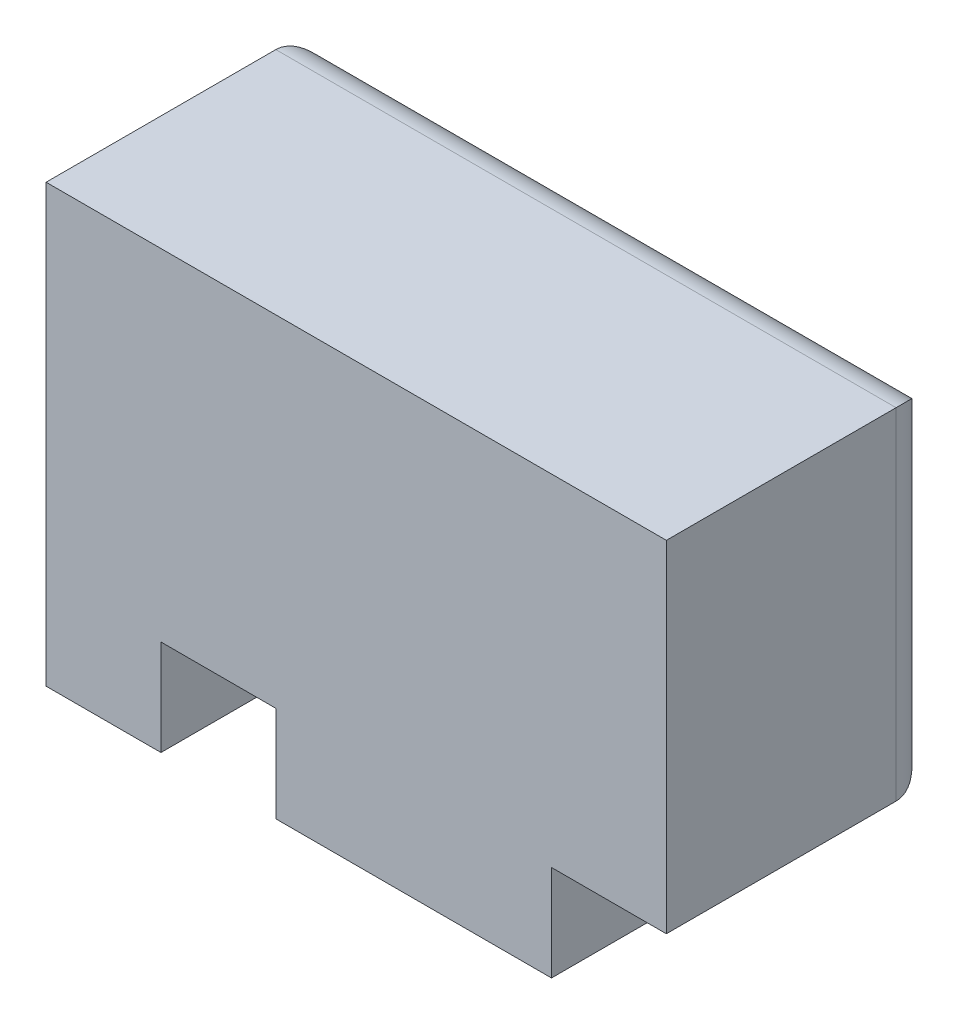
ISO-10303-21;
HEADER;
FILE_DESCRIPTION(('STEP AP214'),'2;1');
FILE_NAME('part.step','',(''),(''),'','','');
FILE_SCHEMA(('AUTOMOTIVE_DESIGN { 1 0 10303 214 1 1 1 1 }'));
ENDSEC;
DATA;
#1=APPLICATION_CONTEXT('core data for automotive mechanical design processes');
#2=APPLICATION_PROTOCOL_DEFINITION('international standard','automotive_design',2000,#1);
#3=PRODUCT_CONTEXT('',#1,'mechanical');
#4=PRODUCT('Part','Part','',(#3));
#5=PRODUCT_RELATED_PRODUCT_CATEGORY('part','',(#4));
#6=PRODUCT_DEFINITION_FORMATION('','',#4);
#7=PRODUCT_DEFINITION_CONTEXT('part definition',#1,'design');
#8=PRODUCT_DEFINITION('design','',#6,#7);
#9=PRODUCT_DEFINITION_SHAPE('','',#8);
#10=(LENGTH_UNIT() NAMED_UNIT(*) SI_UNIT(.MILLI.,.METRE.));
#11=(NAMED_UNIT(*) PLANE_ANGLE_UNIT() SI_UNIT($,.RADIAN.));
#12=(NAMED_UNIT(*) SI_UNIT($,.STERADIAN.) SOLID_ANGLE_UNIT());
#13=UNCERTAINTY_MEASURE_WITH_UNIT(LENGTH_MEASURE(1.E-05),#10,'distance_accuracy_value','');
#14=(GEOMETRIC_REPRESENTATION_CONTEXT(3) GLOBAL_UNCERTAINTY_ASSIGNED_CONTEXT((#13)) GLOBAL_UNIT_ASSIGNED_CONTEXT((#10,
#11,#12)) REPRESENTATION_CONTEXT('',''));
#15=CARTESIAN_POINT('',(0.,0.,0.));
#16=DIRECTION('',(0.,0.,1.));
#17=DIRECTION('',(1.,0.,0.));
#18=AXIS2_PLACEMENT_3D('',#15,#16,#17);
#19=CARTESIAN_POINT('',(0.,0.,7.));
#20=DIRECTION('',(0.,1.,0.));
#21=DIRECTION('',(0.,0.,1.));
#22=AXIS2_PLACEMENT_3D('',#19,#20,#21);
#23=PLANE('',#22);
#24=DIRECTION('',(0.,0.,-1.));
#25=VECTOR('',#24,1.);
#26=CARTESIAN_POINT('',(0.,0.,7.));
#27=LINE('',#26,#25);
#28=CARTESIAN_POINT('',(0.,0.,7.));
#29=VERTEX_POINT('',#28);
#30=CARTESIAN_POINT('',(0.,0.,1.));
#31=VERTEX_POINT('',#30);
#32=EDGE_CURVE('E188',#29,#31,#27,.T.);
#33=ORIENTED_EDGE('',*,*,#32,.T.);
#34=DIRECTION('',(1.,0.,0.));
#35=VECTOR('',#34,1.);
#36=CARTESIAN_POINT('',(3.,0.,1.));
#37=LINE('',#36,#35);
#38=CARTESIAN_POINT('',(3.,0.,1.));
#39=VERTEX_POINT('',#38);
#40=EDGE_CURVE('E57',#31,#39,#37,.T.);
#41=ORIENTED_EDGE('',*,*,#40,.T.);
#42=DIRECTION('',(0.,0.,1.));
#43=VECTOR('',#42,1.);
#44=CARTESIAN_POINT('',(3.,0.,0.));
#45=LINE('',#44,#43);
#46=CARTESIAN_POINT('',(3.,0.,7.));
#47=VERTEX_POINT('',#46);
#48=EDGE_CURVE('E175',#39,#47,#45,.T.);
#49=ORIENTED_EDGE('',*,*,#48,.T.);
#50=DIRECTION('',(1.,0.,0.));
#51=VECTOR('',#50,1.);
#52=CARTESIAN_POINT('',(0.,0.,7.));
#53=LINE('',#52,#51);
#54=EDGE_CURVE('E169',#29,#47,#53,.T.);
#55=ORIENTED_EDGE('',*,*,#54,.F.);
#56=EDGE_LOOP('',(#33,#41,#49,#55));
#57=FACE_BOUND('',#56,.T.);
#58=ADVANCED_FACE('F33',(#57),#23,.F.);
#59=DIRECTION('',(0.,0.,1.));
#60=VECTOR('',#59,1.);
#61=CARTESIAN_POINT('',(6.,0.,0.));
#62=LINE('',#61,#60);
#63=CARTESIAN_POINT('',(6.,0.,1.));
#64=VERTEX_POINT('',#63);
#65=CARTESIAN_POINT('',(6.,0.,7.));
#66=VERTEX_POINT('',#65);
#67=EDGE_CURVE('E142',#64,#66,#62,.T.);
#68=ORIENTED_EDGE('',*,*,#67,.F.);
#69=DIRECTION('',(1.,0.,0.));
#70=VECTOR('',#69,1.);
#71=CARTESIAN_POINT('',(13.2,0.,1.));
#72=LINE('',#71,#70);
#73=CARTESIAN_POINT('',(13.2,0.,1.));
#74=VERTEX_POINT('',#73);
#75=EDGE_CURVE('E212',#64,#74,#72,.T.);
#76=ORIENTED_EDGE('',*,*,#75,.T.);
#77=DIRECTION('',(0.,0.,1.));
#78=VECTOR('',#77,1.);
#79=CARTESIAN_POINT('',(13.2,0.,0.));
#80=LINE('',#79,#78);
#81=CARTESIAN_POINT('',(13.2,0.,7.));
#82=VERTEX_POINT('',#81);
#83=EDGE_CURVE('E167',#74,#82,#80,.T.);
#84=ORIENTED_EDGE('',*,*,#83,.T.);
#85=EDGE_CURVE('E160',#66,#82,#53,.T.);
#86=ORIENTED_EDGE('',*,*,#85,.F.);
#87=EDGE_LOOP('',(#68,#76,#84,#86));
#88=FACE_BOUND('',#87,.T.);
#89=ADVANCED_FACE('F165',(#88),#23,.F.);
#90=CARTESIAN_POINT('',(16.2,0.,7.));
#91=DIRECTION('',(-1.,0.,0.));
#92=DIRECTION('',(0.,-1.,0.));
#93=AXIS2_PLACEMENT_3D('',#90,#91,#92);
#94=PLANE('',#93);
#95=DIRECTION('',(0.,0.,1.));
#96=VECTOR('',#95,1.);
#97=CARTESIAN_POINT('',(16.2,2.5,0.));
#98=LINE('',#97,#96);
#99=CARTESIAN_POINT('',(16.2,2.5,1.));
#100=VERTEX_POINT('',#99);
#101=CARTESIAN_POINT('',(16.2,2.5,7.));
#102=VERTEX_POINT('',#101);
#103=EDGE_CURVE('E163',#100,#102,#98,.T.);
#104=ORIENTED_EDGE('',*,*,#103,.F.);
#105=DIRECTION('',(0.,1.,0.));
#106=VECTOR('',#105,1.);
#107=CARTESIAN_POINT('',(16.2,11.4,1.));
#108=LINE('',#107,#106);
#109=CARTESIAN_POINT('',(16.2,11.4,1.));
#110=VERTEX_POINT('',#109);
#111=EDGE_CURVE('E218',#100,#110,#108,.T.);
#112=ORIENTED_EDGE('',*,*,#111,.T.);
#113=DIRECTION('',(0.,0.,-1.));
#114=VECTOR('',#113,1.);
#115=CARTESIAN_POINT('',(16.2,11.4,7.));
#116=LINE('',#115,#114);
#117=CARTESIAN_POINT('',(16.2,11.4,7.));
#118=VERTEX_POINT('',#117);
#119=EDGE_CURVE('E185',#118,#110,#116,.T.);
#120=ORIENTED_EDGE('',*,*,#119,.F.);
#121=DIRECTION('',(0.,1.,0.));
#122=VECTOR('',#121,1.);
#123=CARTESIAN_POINT('',(16.2,0.,7.));
#124=LINE('',#123,#122);
#125=EDGE_CURVE('E173',#102,#118,#124,.T.);
#126=ORIENTED_EDGE('',*,*,#125,.F.);
#127=EDGE_LOOP('',(#104,#112,#120,#126));
#128=FACE_BOUND('',#127,.T.);
#129=ADVANCED_FACE('F278',(#128),#94,.F.);
#130=CARTESIAN_POINT('',(0.,0.,7.));
#131=DIRECTION('',(0.,0.,-1.));
#132=DIRECTION('',(-1.,0.,0.));
#133=AXIS2_PLACEMENT_3D('',#130,#131,#132);
#134=PLANE('',#133);
#135=DIRECTION('',(0.,1.,0.));
#136=VECTOR('',#135,1.);
#137=CARTESIAN_POINT('',(3.,0.,7.));
#138=LINE('',#137,#136);
#139=CARTESIAN_POINT('',(3.,2.5,7.));
#140=VERTEX_POINT('',#139);
#141=EDGE_CURVE('E153',#47,#140,#138,.T.);
#142=ORIENTED_EDGE('',*,*,#141,.T.);
#143=DIRECTION('',(1.,0.,0.));
#144=VECTOR('',#143,1.);
#145=CARTESIAN_POINT('',(0.,2.5,7.));
#146=LINE('',#145,#144);
#147=CARTESIAN_POINT('',(6.,2.5,7.));
#148=VERTEX_POINT('',#147);
#149=EDGE_CURVE('E162',#140,#148,#146,.T.);
#150=ORIENTED_EDGE('',*,*,#149,.T.);
#151=DIRECTION('',(0.,1.,0.));
#152=VECTOR('',#151,1.);
#153=CARTESIAN_POINT('',(6.,0.,7.));
#154=LINE('',#153,#152);
#155=EDGE_CURVE('E146',#66,#148,#154,.T.);
#156=ORIENTED_EDGE('',*,*,#155,.F.);
#157=ORIENTED_EDGE('',*,*,#85,.T.);
#158=DIRECTION('',(0.,1.,0.));
#159=VECTOR('',#158,1.);
#160=CARTESIAN_POINT('',(13.2,0.,7.));
#161=LINE('',#160,#159);
#162=CARTESIAN_POINT('',(13.2,2.5,7.));
#163=VERTEX_POINT('',#162);
#164=EDGE_CURVE('E260',#82,#163,#161,.T.);
#165=ORIENTED_EDGE('',*,*,#164,.T.);
#166=DIRECTION('',(1.,0.,0.));
#167=VECTOR('',#166,1.);
#168=CARTESIAN_POINT('',(0.,2.5,7.));
#169=LINE('',#168,#167);
#170=EDGE_CURVE('E254',#163,#102,#169,.T.);
#171=ORIENTED_EDGE('',*,*,#170,.T.);
#172=ORIENTED_EDGE('',*,*,#125,.T.);
#173=DIRECTION('',(-1.,0.,0.));
#174=VECTOR('',#173,1.);
#175=CARTESIAN_POINT('',(0.,11.4,7.));
#176=LINE('',#175,#174);
#177=CARTESIAN_POINT('',(0.,11.4,7.));
#178=VERTEX_POINT('',#177);
#179=EDGE_CURVE('E180',#118,#178,#176,.T.);
#180=ORIENTED_EDGE('',*,*,#179,.T.);
#181=DIRECTION('',(0.,-1.,0.));
#182=VECTOR('',#181,1.);
#183=CARTESIAN_POINT('',(0.,0.,7.));
#184=LINE('',#183,#182);
#185=EDGE_CURVE('E170',#178,#29,#184,.T.);
#186=ORIENTED_EDGE('',*,*,#185,.T.);
#187=ORIENTED_EDGE('',*,*,#54,.T.);
#188=EDGE_LOOP('',(#142,#150,#156,#157,#165,#171,#172,#180,#186,#187));
#189=FACE_BOUND('',#188,.T.);
#190=ADVANCED_FACE('F158',(#189),#134,.F.);
#191=CARTESIAN_POINT('',(0.,0.,0.));
#192=DIRECTION('',(0.,0.,-1.));
#193=DIRECTION('',(-1.,0.,0.));
#194=AXIS2_PLACEMENT_3D('',#191,#192,#193);
#195=PLANE('',#194);
#196=DIRECTION('',(1.,0.,0.));
#197=VECTOR('',#196,1.);
#198=CARTESIAN_POINT('',(6.,1.,0.));
#199=LINE('',#198,#197);
#200=CARTESIAN_POINT('',(12.2,1.,0.));
#201=VERTEX_POINT('',#200);
#202=CARTESIAN_POINT('',(7.,1.,0.));
#203=VERTEX_POINT('',#202);
#204=EDGE_CURVE('E206',#201,#203,#199,.F.);
#205=ORIENTED_EDGE('',*,*,#204,.T.);
#206=DIRECTION('',(0.,1.,0.));
#207=VECTOR('',#206,1.);
#208=CARTESIAN_POINT('',(7.,2.5,0.));
#209=LINE('',#208,#207);
#210=CARTESIAN_POINT('',(7.,3.5,0.));
#211=VERTEX_POINT('',#210);
#212=EDGE_CURVE('E208',#203,#211,#209,.T.);
#213=ORIENTED_EDGE('',*,*,#212,.T.);
#214=DIRECTION('',(1.,0.,0.));
#215=VECTOR('',#214,1.);
#216=CARTESIAN_POINT('',(0.,3.5,0.));
#217=LINE('',#216,#215);
#218=CARTESIAN_POINT('',(2.,3.5,0.));
#219=VERTEX_POINT('',#218);
#220=EDGE_CURVE('E190',#211,#219,#217,.F.);
#221=ORIENTED_EDGE('',*,*,#220,.T.);
#222=DIRECTION('',(0.,1.,0.));
#223=VECTOR('',#222,1.);
#224=CARTESIAN_POINT('',(2.,0.,0.));
#225=LINE('',#224,#223);
#226=CARTESIAN_POINT('',(2.,1.,0.));
#227=VERTEX_POINT('',#226);
#228=EDGE_CURVE('E192',#219,#227,#225,.F.);
#229=ORIENTED_EDGE('',*,*,#228,.T.);
#230=DIRECTION('',(1.,0.,0.));
#231=VECTOR('',#230,1.);
#232=CARTESIAN_POINT('',(0.,1.,0.));
#233=LINE('',#232,#231);
#234=CARTESIAN_POINT('',(1.,1.,0.));
#235=VERTEX_POINT('',#234);
#236=EDGE_CURVE('E194',#227,#235,#233,.F.);
#237=ORIENTED_EDGE('',*,*,#236,.T.);
#238=DIRECTION('',(0.,-1.,0.));
#239=VECTOR('',#238,1.);
#240=CARTESIAN_POINT('',(0.999999999999997,11.4,0.));
#241=LINE('',#240,#239);
#242=CARTESIAN_POINT('',(0.999999999999997,10.4,0.));
#243=VERTEX_POINT('',#242);
#244=EDGE_CURVE('E196',#235,#243,#241,.F.);
#245=ORIENTED_EDGE('',*,*,#244,.T.);
#246=DIRECTION('',(-1.,0.,0.));
#247=VECTOR('',#246,1.);
#248=CARTESIAN_POINT('',(16.2,10.4,0.));
#249=LINE('',#248,#247);
#250=CARTESIAN_POINT('',(15.2,10.4,0.));
#251=VERTEX_POINT('',#250);
#252=EDGE_CURVE('E198',#243,#251,#249,.F.);
#253=ORIENTED_EDGE('',*,*,#252,.T.);
#254=DIRECTION('',(0.,1.,0.));
#255=VECTOR('',#254,1.);
#256=CARTESIAN_POINT('',(15.2,2.5,0.));
#257=LINE('',#256,#255);
#258=CARTESIAN_POINT('',(15.2,3.5,0.));
#259=VERTEX_POINT('',#258);
#260=EDGE_CURVE('E200',#251,#259,#257,.F.);
#261=ORIENTED_EDGE('',*,*,#260,.T.);
#262=DIRECTION('',(1.,0.,0.));
#263=VECTOR('',#262,1.);
#264=CARTESIAN_POINT('',(0.,3.5,0.));
#265=LINE('',#264,#263);
#266=CARTESIAN_POINT('',(12.2,3.5,0.));
#267=VERTEX_POINT('',#266);
#268=EDGE_CURVE('E202',#259,#267,#265,.F.);
#269=ORIENTED_EDGE('',*,*,#268,.T.);
#270=DIRECTION('',(0.,1.,0.));
#271=VECTOR('',#270,1.);
#272=CARTESIAN_POINT('',(12.2,0.,0.));
#273=LINE('',#272,#271);
#274=EDGE_CURVE('E204',#267,#201,#273,.F.);
#275=ORIENTED_EDGE('',*,*,#274,.T.);
#276=EDGE_LOOP('',(#205,#213,#221,#229,#237,#245,#253,#261,#269,#275));
#277=FACE_BOUND('',#276,.T.);
#278=ADVANCED_FACE('F288',(#277),#195,.T.);
#279=CARTESIAN_POINT('',(0.,0.,7.));
#280=DIRECTION('',(1.,0.,0.));
#281=DIRECTION('',(0.,1.,0.));
#282=AXIS2_PLACEMENT_3D('',#279,#280,#281);
#283=PLANE('',#282);
#284=DIRECTION('',(0.,0.,-1.));
#285=VECTOR('',#284,1.);
#286=CARTESIAN_POINT('',(0.,11.4,7.));
#287=LINE('',#286,#285);
#288=CARTESIAN_POINT('',(0.,11.4,1.));
#289=VERTEX_POINT('',#288);
#290=EDGE_CURVE('E182',#178,#289,#287,.T.);
#291=ORIENTED_EDGE('',*,*,#290,.T.);
#292=DIRECTION('',(0.,-1.,0.));
#293=VECTOR('',#292,1.);
#294=CARTESIAN_POINT('',(0.,0.,1.));
#295=LINE('',#294,#293);
#296=EDGE_CURVE('E222',#289,#31,#295,.T.);
#297=ORIENTED_EDGE('',*,*,#296,.T.);
#298=ORIENTED_EDGE('',*,*,#32,.F.);
#299=ORIENTED_EDGE('',*,*,#185,.F.);
#300=EDGE_LOOP('',(#291,#297,#298,#299));
#301=FACE_BOUND('',#300,.T.);
#302=ADVANCED_FACE('F299',(#301),#283,.F.);
#303=CARTESIAN_POINT('',(0.,11.4,7.));
#304=DIRECTION('',(0.,-1.,0.));
#305=DIRECTION('',(0.,0.,-1.));
#306=AXIS2_PLACEMENT_3D('',#303,#304,#305);
#307=PLANE('',#306);
#308=ORIENTED_EDGE('',*,*,#119,.T.);
#309=DIRECTION('',(-1.,0.,0.));
#310=VECTOR('',#309,1.);
#311=CARTESIAN_POINT('',(0.,11.4,1.));
#312=LINE('',#311,#310);
#313=EDGE_CURVE('E220',#110,#289,#312,.T.);
#314=ORIENTED_EDGE('',*,*,#313,.T.);
#315=ORIENTED_EDGE('',*,*,#290,.F.);
#316=ORIENTED_EDGE('',*,*,#179,.F.);
#317=EDGE_LOOP('',(#308,#314,#315,#316));
#318=FACE_BOUND('',#317,.T.);
#319=ADVANCED_FACE('F295',(#318),#307,.F.);
#320=CARTESIAN_POINT('',(0.,2.5,0.));
#321=DIRECTION('',(0.,-1.,0.));
#322=DIRECTION('',(0.,0.,-1.));
#323=AXIS2_PLACEMENT_3D('',#320,#321,#322);
#324=PLANE('',#323);
#325=DIRECTION('',(0.,0.,1.));
#326=VECTOR('',#325,1.);
#327=CARTESIAN_POINT('',(13.2,2.5,0.));
#328=LINE('',#327,#326);
#329=CARTESIAN_POINT('',(13.2,2.5,1.));
#330=VERTEX_POINT('',#329);
#331=EDGE_CURVE('E264',#330,#163,#328,.T.);
#332=ORIENTED_EDGE('',*,*,#331,.F.);
#333=DIRECTION('',(1.,0.,0.));
#334=VECTOR('',#333,1.);
#335=CARTESIAN_POINT('',(0.,2.5,1.));
#336=LINE('',#335,#334);
#337=EDGE_CURVE('E216',#330,#100,#336,.T.);
#338=ORIENTED_EDGE('',*,*,#337,.T.);
#339=ORIENTED_EDGE('',*,*,#103,.T.);
#340=ORIENTED_EDGE('',*,*,#170,.F.);
#341=EDGE_LOOP('',(#332,#338,#339,#340));
#342=FACE_BOUND('',#341,.T.);
#343=ADVANCED_FACE('F275',(#342),#324,.T.);
#344=CARTESIAN_POINT('',(13.2,0.,0.));
#345=DIRECTION('',(1.,0.,0.));
#346=DIRECTION('',(0.,0.,-1.));
#347=AXIS2_PLACEMENT_3D('',#344,#345,#346);
#348=PLANE('',#347);
#349=ORIENTED_EDGE('',*,*,#83,.F.);
#350=DIRECTION('',(0.,1.,0.));
#351=VECTOR('',#350,1.);
#352=CARTESIAN_POINT('',(13.2,0.,1.));
#353=LINE('',#352,#351);
#354=EDGE_CURVE('E214',#74,#330,#353,.T.);
#355=ORIENTED_EDGE('',*,*,#354,.T.);
#356=ORIENTED_EDGE('',*,*,#331,.T.);
#357=ORIENTED_EDGE('',*,*,#164,.F.);
#358=EDGE_LOOP('',(#349,#355,#356,#357));
#359=FACE_BOUND('',#358,.T.);
#360=ADVANCED_FACE('F271',(#359),#348,.T.);
#361=CARTESIAN_POINT('',(3.,0.,0.));
#362=DIRECTION('',(1.,0.,0.));
#363=DIRECTION('',(0.,0.,-1.));
#364=AXIS2_PLACEMENT_3D('',#361,#362,#363);
#365=PLANE('',#364);
#366=ORIENTED_EDGE('',*,*,#48,.F.);
#367=DIRECTION('',(0.,1.,0.));
#368=VECTOR('',#367,1.);
#369=CARTESIAN_POINT('',(3.,0.,1.));
#370=LINE('',#369,#368);
#371=CARTESIAN_POINT('',(3.,2.5,1.));
#372=VERTEX_POINT('',#371);
#373=EDGE_CURVE('E42',#39,#372,#370,.T.);
#374=ORIENTED_EDGE('',*,*,#373,.T.);
#375=DIRECTION('',(0.,0.,1.));
#376=VECTOR('',#375,1.);
#377=CARTESIAN_POINT('',(3.,2.5,0.));
#378=LINE('',#377,#376);
#379=EDGE_CURVE('E304',#372,#140,#378,.T.);
#380=ORIENTED_EDGE('',*,*,#379,.T.);
#381=ORIENTED_EDGE('',*,*,#141,.F.);
#382=EDGE_LOOP('',(#366,#374,#380,#381));
#383=FACE_BOUND('',#382,.T.);
#384=ADVANCED_FACE('F306',(#383),#365,.T.);
#385=CARTESIAN_POINT('',(0.,2.5,0.));
#386=DIRECTION('',(0.,-1.,0.));
#387=DIRECTION('',(1.,0.,0.));
#388=AXIS2_PLACEMENT_3D('',#385,#386,#387);
#389=PLANE('',#388);
#390=ORIENTED_EDGE('',*,*,#379,.F.);
#391=DIRECTION('',(1.,0.,0.));
#392=VECTOR('',#391,1.);
#393=CARTESIAN_POINT('',(0.,2.5,1.));
#394=LINE('',#393,#392);
#395=CARTESIAN_POINT('',(6.,2.5,1.));
#396=VERTEX_POINT('',#395);
#397=EDGE_CURVE('E11',#372,#396,#394,.T.);
#398=ORIENTED_EDGE('',*,*,#397,.T.);
#399=DIRECTION('',(0.,0.,1.));
#400=VECTOR('',#399,1.);
#401=CARTESIAN_POINT('',(6.,2.5,0.));
#402=LINE('',#401,#400);
#403=EDGE_CURVE('E152',#396,#148,#402,.T.);
#404=ORIENTED_EDGE('',*,*,#403,.T.);
#405=ORIENTED_EDGE('',*,*,#149,.F.);
#406=EDGE_LOOP('',(#390,#398,#404,#405));
#407=FACE_BOUND('',#406,.T.);
#408=ADVANCED_FACE('F311',(#407),#389,.T.);
#409=CARTESIAN_POINT('',(6.,0.,0.));
#410=DIRECTION('',(1.,0.,0.));
#411=DIRECTION('',(0.,0.,-1.));
#412=AXIS2_PLACEMENT_3D('',#409,#410,#411);
#413=PLANE('',#412);
#414=ORIENTED_EDGE('',*,*,#403,.F.);
#415=DIRECTION('',(0.,1.,0.));
#416=VECTOR('',#415,1.);
#417=CARTESIAN_POINT('',(6.,0.,1.));
#418=LINE('',#417,#416);
#419=EDGE_CURVE('E149',#396,#64,#418,.F.);
#420=ORIENTED_EDGE('',*,*,#419,.T.);
#421=ORIENTED_EDGE('',*,*,#67,.T.);
#422=ORIENTED_EDGE('',*,*,#155,.T.);
#423=EDGE_LOOP('',(#414,#420,#421,#422));
#424=FACE_BOUND('',#423,.T.);
#425=ADVANCED_FACE('F145',(#424),#413,.F.);
#426=CARTESIAN_POINT('',(0.,10.4,1.));
#427=DIRECTION('',(1.,0.,0.));
#428=DIRECTION('',(0.,0.,-1.));
#429=AXIS2_PLACEMENT_3D('',#426,#427,#428);
#430=CYLINDRICAL_SURFACE('',#429,1.);
#431=CARTESIAN_POINT('',(0.999999999999997,10.4,1.));
#432=DIRECTION('',(0.707106781186547,0.707106781186548,0.));
#433=DIRECTION('',(-0.707106781186548,0.707106781186547,0.));
#434=AXIS2_PLACEMENT_3D('',#431,#432,#433);
#435=ELLIPSE('',#434,1.4142135623731,1.);
#436=EDGE_CURVE('E247',#289,#243,#435,.F.);
#437=ORIENTED_EDGE('',*,*,#436,.F.);
#438=ORIENTED_EDGE('',*,*,#313,.F.);
#439=CARTESIAN_POINT('',(15.2,10.4,1.));
#440=DIRECTION('',(0.707106781186548,-0.707106781186547,0.));
#441=DIRECTION('',(0.707106781186547,0.707106781186548,0.));
#442=AXIS2_PLACEMENT_3D('',#439,#440,#441);
#443=ELLIPSE('',#442,1.41421356237309,1.);
#444=EDGE_CURVE('E37',#251,#110,#443,.T.);
#445=ORIENTED_EDGE('',*,*,#444,.F.);
#446=ORIENTED_EDGE('',*,*,#252,.F.);
#447=EDGE_LOOP('',(#437,#438,#445,#446));
#448=FACE_BOUND('',#447,.T.);
#449=ADVANCED_FACE('F35',(#448),#430,.T.);
#450=CARTESIAN_POINT('',(15.2,0.,1.));
#451=DIRECTION('',(0.,-1.,0.));
#452=DIRECTION('',(1.,0.,0.));
#453=AXIS2_PLACEMENT_3D('',#450,#451,#452);
#454=CYLINDRICAL_SURFACE('',#453,1.);
#455=ORIENTED_EDGE('',*,*,#444,.T.);
#456=ORIENTED_EDGE('',*,*,#111,.F.);
#457=CARTESIAN_POINT('',(15.2,3.5,1.));
#458=DIRECTION('',(-0.707106781186547,-0.707106781186548,0.));
#459=DIRECTION('',(0.707106781186548,-0.707106781186547,0.));
#460=AXIS2_PLACEMENT_3D('',#457,#458,#459);
#461=ELLIPSE('',#460,1.4142135623731,1.);
#462=EDGE_CURVE('E245',#259,#100,#461,.T.);
#463=ORIENTED_EDGE('',*,*,#462,.F.);
#464=ORIENTED_EDGE('',*,*,#260,.F.);
#465=EDGE_LOOP('',(#455,#456,#463,#464));
#466=FACE_BOUND('',#465,.T.);
#467=ADVANCED_FACE('F281',(#466),#454,.T.);
#468=CARTESIAN_POINT('',(1.,0.,1.));
#469=DIRECTION('',(0.,1.,0.));
#470=DIRECTION('',(-1.,0.,0.));
#471=AXIS2_PLACEMENT_3D('',#468,#469,#470);
#472=CYLINDRICAL_SURFACE('',#471,1.);
#473=ORIENTED_EDGE('',*,*,#436,.T.);
#474=ORIENTED_EDGE('',*,*,#244,.F.);
#475=CARTESIAN_POINT('',(1.,1.,1.));
#476=DIRECTION('',(-0.707106781186548,0.707106781186547,0.));
#477=DIRECTION('',(-0.707106781186547,-0.707106781186548,0.));
#478=AXIS2_PLACEMENT_3D('',#475,#476,#477);
#479=ELLIPSE('',#478,1.41421356237309,1.);
#480=EDGE_CURVE('E242',#31,#235,#479,.F.);
#481=ORIENTED_EDGE('',*,*,#480,.F.);
#482=ORIENTED_EDGE('',*,*,#296,.F.);
#483=EDGE_LOOP('',(#473,#474,#481,#482));
#484=FACE_BOUND('',#483,.T.);
#485=ADVANCED_FACE('F395',(#484),#472,.T.);
#486=CARTESIAN_POINT('',(0.,3.5,1.));
#487=DIRECTION('',(1.,0.,0.));
#488=DIRECTION('',(0.,0.,-1.));
#489=AXIS2_PLACEMENT_3D('',#486,#487,#488);
#490=CYLINDRICAL_SURFACE('',#489,1.);
#491=ORIENTED_EDGE('',*,*,#462,.T.);
#492=ORIENTED_EDGE('',*,*,#337,.F.);
#493=CARTESIAN_POINT('',(12.2,3.5,1.));
#494=DIRECTION('',(0.707106781186547,0.707106781186547,0.));
#495=DIRECTION('',(-0.707106781186547,0.707106781186547,0.));
#496=AXIS2_PLACEMENT_3D('',#493,#494,#495);
#497=ELLIPSE('',#496,1.41421356237309,1.);
#498=EDGE_CURVE('E239',#267,#330,#497,.F.);
#499=ORIENTED_EDGE('',*,*,#498,.F.);
#500=ORIENTED_EDGE('',*,*,#268,.F.);
#501=EDGE_LOOP('',(#491,#492,#499,#500));
#502=FACE_BOUND('',#501,.T.);
#503=ADVANCED_FACE('F284',(#502),#490,.T.);
#504=CARTESIAN_POINT('',(0.,1.,1.));
#505=DIRECTION('',(-1.,0.,0.));
#506=DIRECTION('',(0.,0.,1.));
#507=AXIS2_PLACEMENT_3D('',#504,#505,#506);
#508=CYLINDRICAL_SURFACE('',#507,1.);
#509=ORIENTED_EDGE('',*,*,#480,.T.);
#510=ORIENTED_EDGE('',*,*,#236,.F.);
#511=CARTESIAN_POINT('',(2.,1.,1.));
#512=DIRECTION('',(0.707106781186547,0.707106781186547,0.));
#513=DIRECTION('',(-0.707106781186547,0.707106781186547,0.));
#514=AXIS2_PLACEMENT_3D('',#511,#512,#513);
#515=ELLIPSE('',#514,1.41421356237309,1.);
#516=EDGE_CURVE('E236',#39,#227,#515,.T.);
#517=ORIENTED_EDGE('',*,*,#516,.F.);
#518=ORIENTED_EDGE('',*,*,#40,.F.);
#519=EDGE_LOOP('',(#509,#510,#517,#518));
#520=FACE_BOUND('',#519,.T.);
#521=ADVANCED_FACE('F331',(#520),#508,.T.);
#522=CARTESIAN_POINT('',(12.2,0.,1.));
#523=DIRECTION('',(0.,1.,0.));
#524=DIRECTION('',(0.,0.,1.));
#525=AXIS2_PLACEMENT_3D('',#522,#523,#524);
#526=CYLINDRICAL_SURFACE('',#525,1.);
#527=ORIENTED_EDGE('',*,*,#498,.T.);
#528=ORIENTED_EDGE('',*,*,#354,.F.);
#529=CARTESIAN_POINT('',(12.2,1.,1.));
#530=DIRECTION('',(0.707106781186547,0.707106781186547,0.));
#531=DIRECTION('',(-0.707106781186547,0.707106781186547,0.));
#532=AXIS2_PLACEMENT_3D('',#529,#530,#531);
#533=ELLIPSE('',#532,1.41421356237309,1.);
#534=EDGE_CURVE('E233',#201,#74,#533,.F.);
#535=ORIENTED_EDGE('',*,*,#534,.F.);
#536=ORIENTED_EDGE('',*,*,#274,.F.);
#537=EDGE_LOOP('',(#527,#528,#535,#536));
#538=FACE_BOUND('',#537,.T.);
#539=ADVANCED_FACE('F328',(#538),#526,.T.);
#540=CARTESIAN_POINT('',(2.,0.,1.));
#541=DIRECTION('',(0.,1.,0.));
#542=DIRECTION('',(0.,0.,1.));
#543=AXIS2_PLACEMENT_3D('',#540,#541,#542);
#544=CYLINDRICAL_SURFACE('',#543,1.);
#545=ORIENTED_EDGE('',*,*,#516,.T.);
#546=ORIENTED_EDGE('',*,*,#228,.F.);
#547=CARTESIAN_POINT('',(2.,3.5,1.));
#548=DIRECTION('',(0.707106781186548,0.707106781186547,0.));
#549=DIRECTION('',(-0.707106781186547,0.707106781186548,0.));
#550=AXIS2_PLACEMENT_3D('',#547,#548,#549);
#551=ELLIPSE('',#550,1.4142135623731,1.);
#552=EDGE_CURVE('E230',#372,#219,#551,.T.);
#553=ORIENTED_EDGE('',*,*,#552,.F.);
#554=ORIENTED_EDGE('',*,*,#373,.F.);
#555=EDGE_LOOP('',(#545,#546,#553,#554));
#556=FACE_BOUND('',#555,.T.);
#557=ADVANCED_FACE('F330',(#556),#544,.T.);
#558=CARTESIAN_POINT('',(0.,1.,1.));
#559=DIRECTION('',(-1.,0.,0.));
#560=DIRECTION('',(0.,0.,1.));
#561=AXIS2_PLACEMENT_3D('',#558,#559,#560);
#562=CYLINDRICAL_SURFACE('',#561,1.);
#563=ORIENTED_EDGE('',*,*,#534,.T.);
#564=ORIENTED_EDGE('',*,*,#75,.F.);
#565=CARTESIAN_POINT('',(7.,1.,1.));
#566=DIRECTION('',(-0.707106781186547,0.707106781186547,0.));
#567=DIRECTION('',(-0.707106781186547,-0.707106781186547,0.));
#568=AXIS2_PLACEMENT_3D('',#565,#566,#567);
#569=ELLIPSE('',#568,1.41421356237309,1.);
#570=EDGE_CURVE('E228',#203,#64,#569,.T.);
#571=ORIENTED_EDGE('',*,*,#570,.F.);
#572=ORIENTED_EDGE('',*,*,#204,.F.);
#573=EDGE_LOOP('',(#563,#564,#571,#572));
#574=FACE_BOUND('',#573,.T.);
#575=ADVANCED_FACE('F326',(#574),#562,.T.);
#576=CARTESIAN_POINT('',(0.,3.5,1.));
#577=DIRECTION('',(1.,0.,0.));
#578=DIRECTION('',(0.,1.,0.));
#579=AXIS2_PLACEMENT_3D('',#576,#577,#578);
#580=CYLINDRICAL_SURFACE('',#579,1.);
#581=ORIENTED_EDGE('',*,*,#552,.T.);
#582=ORIENTED_EDGE('',*,*,#220,.F.);
#583=CARTESIAN_POINT('',(7.,3.5,1.));
#584=DIRECTION('',(0.707106781186547,-0.707106781186548,0.));
#585=DIRECTION('',(-0.707106781186548,-0.707106781186547,0.));
#586=AXIS2_PLACEMENT_3D('',#583,#584,#585);
#587=ELLIPSE('',#586,1.41421356237309,1.);
#588=EDGE_CURVE('E226',#396,#211,#587,.T.);
#589=ORIENTED_EDGE('',*,*,#588,.F.);
#590=ORIENTED_EDGE('',*,*,#397,.F.);
#591=EDGE_LOOP('',(#581,#582,#589,#590));
#592=FACE_BOUND('',#591,.T.);
#593=ADVANCED_FACE('F321',(#592),#580,.T.);
#594=CARTESIAN_POINT('',(7.,0.,1.));
#595=DIRECTION('',(0.,-1.,0.));
#596=DIRECTION('',(0.,0.,-1.));
#597=AXIS2_PLACEMENT_3D('',#594,#595,#596);
#598=CYLINDRICAL_SURFACE('',#597,1.);
#599=ORIENTED_EDGE('',*,*,#570,.T.);
#600=ORIENTED_EDGE('',*,*,#419,.F.);
#601=ORIENTED_EDGE('',*,*,#588,.T.);
#602=ORIENTED_EDGE('',*,*,#212,.F.);
#603=EDGE_LOOP('',(#599,#600,#601,#602));
#604=FACE_BOUND('',#603,.T.);
#605=ADVANCED_FACE('F315',(#604),#598,.T.);
#606=CLOSED_SHELL('',(#58,#89,#129,#190,#278,#302,#319,#343,#360,#384,#408,#425,#449,#467,#485,
#503,#521,#539,#557,#575,#593,#605));
#607=MANIFOLD_SOLID_BREP('B2',#606);
#608=ADVANCED_BREP_SHAPE_REPRESENTATION('',(#18,#607),#14);
#609=SHAPE_DEFINITION_REPRESENTATION(#9,#608);
ENDSEC;
END-ISO-10303-21;
